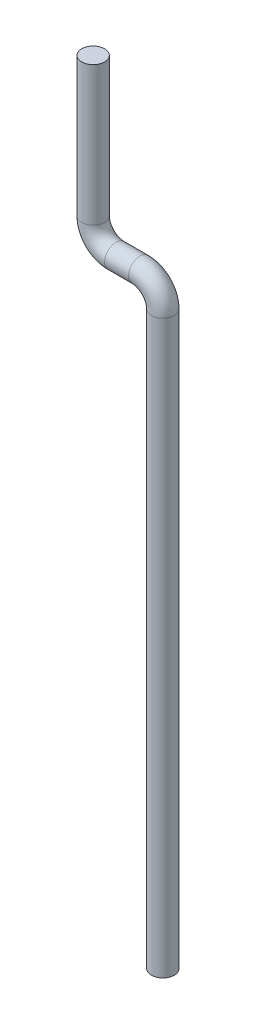
ISO-10303-21;
HEADER;
FILE_DESCRIPTION(('STEP AP214'),'2;1');
FILE_NAME('part.step','',(''),(''),'','','');
FILE_SCHEMA(('AUTOMOTIVE_DESIGN { 1 0 10303 214 1 1 1 1 }'));
ENDSEC;
DATA;
#1=APPLICATION_CONTEXT('core data for automotive mechanical design processes');
#2=APPLICATION_PROTOCOL_DEFINITION('international standard','automotive_design',2000,#1);
#3=PRODUCT_CONTEXT('',#1,'mechanical');
#4=PRODUCT('Part','Part','',(#3));
#5=PRODUCT_RELATED_PRODUCT_CATEGORY('part','',(#4));
#6=PRODUCT_DEFINITION_FORMATION('','',#4);
#7=PRODUCT_DEFINITION_CONTEXT('part definition',#1,'design');
#8=PRODUCT_DEFINITION('design','',#6,#7);
#9=PRODUCT_DEFINITION_SHAPE('','',#8);
#10=(LENGTH_UNIT() NAMED_UNIT(*) SI_UNIT(.MILLI.,.METRE.));
#11=(NAMED_UNIT(*) PLANE_ANGLE_UNIT() SI_UNIT($,.RADIAN.));
#12=(NAMED_UNIT(*) SI_UNIT($,.STERADIAN.) SOLID_ANGLE_UNIT());
#13=UNCERTAINTY_MEASURE_WITH_UNIT(LENGTH_MEASURE(1.E-05),#10,'distance_accuracy_value','');
#14=(GEOMETRIC_REPRESENTATION_CONTEXT(3) GLOBAL_UNCERTAINTY_ASSIGNED_CONTEXT((#13)) GLOBAL_UNIT_ASSIGNED_CONTEXT((#10,
#11,#12)) REPRESENTATION_CONTEXT('',''));
#15=CARTESIAN_POINT('',(0.,0.,0.));
#16=DIRECTION('',(0.,0.,1.));
#17=DIRECTION('',(1.,0.,0.));
#18=AXIS2_PLACEMENT_3D('',#15,#16,#17);
#19=CARTESIAN_POINT('',(1.76489393493551,-4.,0.));
#20=DIRECTION('',(0.,-1.,0.));
#21=DIRECTION('',(0.,0.,-1.));
#22=AXIS2_PLACEMENT_3D('',#19,#20,#21);
#23=PLANE('',#22);
#24=CARTESIAN_POINT('',(1.76489393493551,-4.,0.));
#25=DIRECTION('',(0.,-1.,0.));
#26=DIRECTION('',(1.,0.,0.));
#27=AXIS2_PLACEMENT_3D('',#24,#25,#26);
#28=CIRCLE('',#27,0.500000000000001);
#29=CARTESIAN_POINT('',(2.26489393493551,-4.,0.));
#30=VERTEX_POINT('',#29);
#31=EDGE_CURVE('E18',#30,#30,#28,.T.);
#32=ORIENTED_EDGE('',*,*,#31,.F.);
#33=EDGE_LOOP('',(#32));
#34=FACE_BOUND('',#33,.T.);
#35=ADVANCED_FACE('F15',(#34),#23,.F.);
#36=CARTESIAN_POINT('',(1.76489393493551,-10.0782956818485,0.));
#37=DIRECTION('',(0.,-1.,0.));
#38=DIRECTION('',(1.,0.,0.));
#39=AXIS2_PLACEMENT_3D('',#36,#37,#38);
#40=CYLINDRICAL_SURFACE('',#39,0.500000000000001);
#41=CARTESIAN_POINT('',(1.76489393493551,-10.0782956818485,0.));
#42=DIRECTION('',(0.,-1.,0.));
#43=DIRECTION('',(-1.,0.,0.));
#44=AXIS2_PLACEMENT_3D('',#41,#42,#43);
#45=CIRCLE('',#44,0.500000000000001);
#46=CARTESIAN_POINT('',(1.26489393493551,-10.0782956818485,0.));
#47=VERTEX_POINT('',#46);
#48=EDGE_CURVE('E29',#47,#47,#45,.T.);
#49=ORIENTED_EDGE('',*,*,#48,.F.);
#50=EDGE_LOOP('',(#49));
#51=FACE_BOUND('',#50,.T.);
#52=ORIENTED_EDGE('',*,*,#31,.T.);
#53=EDGE_LOOP('',(#52));
#54=FACE_BOUND('',#53,.T.);
#55=ADVANCED_FACE('F43',(#51,#54),#40,.T.);
#56=CARTESIAN_POINT('',(2.76489393493551,-10.0782956818485,0.));
#57=DIRECTION('',(0.,0.,1.));
#58=DIRECTION('',(1.,0.,0.));
#59=AXIS2_PLACEMENT_3D('',#56,#57,#58);
#60=TOROIDAL_SURFACE('',#59,1.,0.500000000000001);
#61=ORIENTED_EDGE('',*,*,#48,.T.);
#62=EDGE_LOOP('',(#61));
#63=FACE_BOUND('',#62,.T.);
#64=CARTESIAN_POINT('',(2.76489393493551,-11.0782956818485,0.));
#65=DIRECTION('',(-1.,0.,0.));
#66=DIRECTION('',(0.,0.,1.));
#67=AXIS2_PLACEMENT_3D('',#64,#65,#66);
#68=CIRCLE('',#67,0.500000000000001);
#69=CARTESIAN_POINT('',(2.76489393493551,-11.0782956818485,0.500000000000001));
#70=VERTEX_POINT('',#69);
#71=EDGE_CURVE('E32',#70,#70,#68,.F.);
#72=ORIENTED_EDGE('',*,*,#71,.F.);
#73=EDGE_LOOP('',(#72));
#74=FACE_BOUND('',#73,.T.);
#75=ADVANCED_FACE('F39',(#63,#74),#60,.T.);
#76=CARTESIAN_POINT('',(2.76489393493551,-11.0782956818485,0.));
#77=DIRECTION('',(-1.,0.,0.));
#78=DIRECTION('',(0.,0.,1.));
#79=AXIS2_PLACEMENT_3D('',#76,#77,#78);
#80=CYLINDRICAL_SURFACE('',#79,0.500000000000001);
#81=CARTESIAN_POINT('',(3.81147164826661,-11.0782956818485,0.));
#82=DIRECTION('',(1.,0.,0.));
#83=DIRECTION('',(0.,1.,0.));
#84=AXIS2_PLACEMENT_3D('',#81,#82,#83);
#85=CIRCLE('',#84,0.500000000000001);
#86=CARTESIAN_POINT('',(3.81147164826661,-10.5782956818485,0.));
#87=VERTEX_POINT('',#86);
#88=EDGE_CURVE('E26',#87,#87,#85,.T.);
#89=ORIENTED_EDGE('',*,*,#88,.F.);
#90=EDGE_LOOP('',(#89));
#91=FACE_BOUND('',#90,.T.);
#92=ORIENTED_EDGE('',*,*,#71,.T.);
#93=EDGE_LOOP('',(#92));
#94=FACE_BOUND('',#93,.T.);
#95=ADVANCED_FACE('F42',(#91,#94),#80,.T.);
#96=CARTESIAN_POINT('',(3.81147164826661,-12.0782956818485,0.));
#97=DIRECTION('',(0.,0.,-1.));
#98=DIRECTION('',(-1.,0.,0.));
#99=AXIS2_PLACEMENT_3D('',#96,#97,#98);
#100=TOROIDAL_SURFACE('',#99,1.,0.500000000000001);
#101=ORIENTED_EDGE('',*,*,#88,.T.);
#102=EDGE_LOOP('',(#101));
#103=FACE_BOUND('',#102,.T.);
#104=CARTESIAN_POINT('',(4.81147164826661,-12.0782956818485,0.));
#105=DIRECTION('',(0.,1.,0.));
#106=DIRECTION('',(-1.,0.,0.));
#107=AXIS2_PLACEMENT_3D('',#104,#105,#106);
#108=CIRCLE('',#107,0.500000000000001);
#109=CARTESIAN_POINT('',(4.31147164826661,-12.0782956818485,0.));
#110=VERTEX_POINT('',#109);
#111=EDGE_CURVE('E22',#110,#110,#108,.F.);
#112=ORIENTED_EDGE('',*,*,#111,.F.);
#113=EDGE_LOOP('',(#112));
#114=FACE_BOUND('',#113,.T.);
#115=ADVANCED_FACE('F62',(#103,#114),#100,.T.);
#116=CARTESIAN_POINT('',(4.81147164826661,-37.0612,0.));
#117=DIRECTION('',(0.,-1.,0.));
#118=DIRECTION('',(0.,0.,-1.));
#119=AXIS2_PLACEMENT_3D('',#116,#117,#118);
#120=PLANE('',#119);
#121=CARTESIAN_POINT('',(4.81147164826661,-37.0612,0.));
#122=DIRECTION('',(0.,1.,0.));
#123=DIRECTION('',(-1.,0.,0.));
#124=AXIS2_PLACEMENT_3D('',#121,#122,#123);
#125=CIRCLE('',#124,0.500000000000001);
#126=CARTESIAN_POINT('',(4.31147164826661,-37.0612,0.));
#127=VERTEX_POINT('',#126);
#128=EDGE_CURVE('E10',#127,#127,#125,.T.);
#129=ORIENTED_EDGE('',*,*,#128,.F.);
#130=EDGE_LOOP('',(#129));
#131=FACE_BOUND('',#130,.T.);
#132=ADVANCED_FACE('F57',(#131),#120,.T.);
#133=CARTESIAN_POINT('',(4.81147164826661,-12.0782956818485,0.));
#134=DIRECTION('',(0.,1.,0.));
#135=DIRECTION('',(-1.,0.,0.));
#136=AXIS2_PLACEMENT_3D('',#133,#134,#135);
#137=CYLINDRICAL_SURFACE('',#136,0.500000000000001);
#138=ORIENTED_EDGE('',*,*,#128,.T.);
#139=EDGE_LOOP('',(#138));
#140=FACE_BOUND('',#139,.T.);
#141=ORIENTED_EDGE('',*,*,#111,.T.);
#142=EDGE_LOOP('',(#141));
#143=FACE_BOUND('',#142,.T.);
#144=ADVANCED_FACE('F55',(#140,#143),#137,.T.);
#145=CLOSED_SHELL('',(#35,#55,#75,#95,#115,#132,#144));
#146=MANIFOLD_SOLID_BREP('B1',#145);
#147=ADVANCED_BREP_SHAPE_REPRESENTATION('',(#18,#146),#14);
#148=SHAPE_DEFINITION_REPRESENTATION(#9,#147);
ENDSEC;
END-ISO-10303-21;
